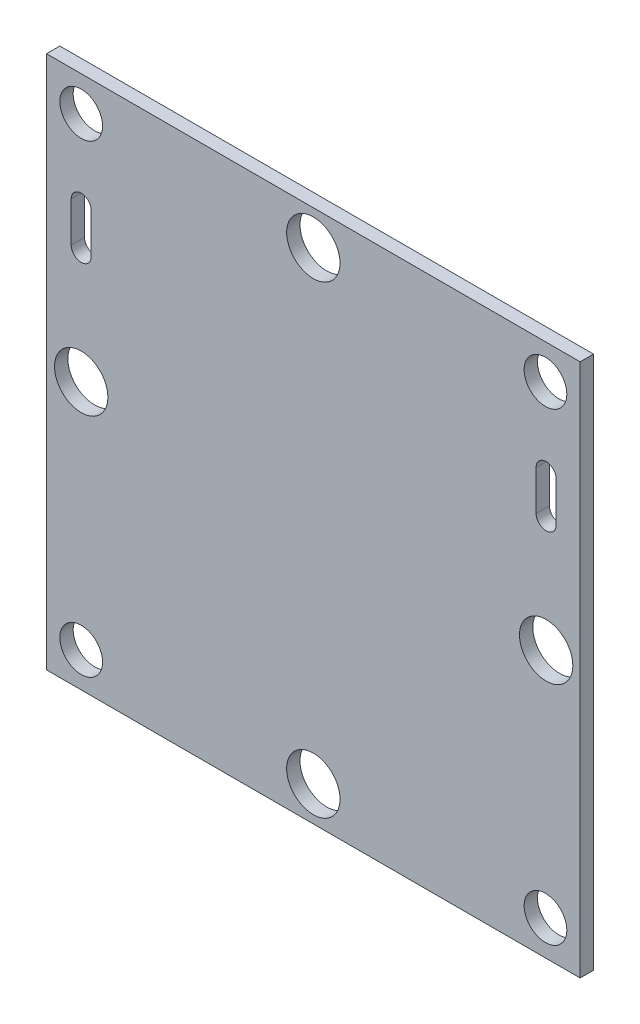
ISO-10303-21;
HEADER;
FILE_DESCRIPTION(('STEP AP214'),'2;1');
FILE_NAME('part.step','',(''),(''),'','','');
FILE_SCHEMA(('AUTOMOTIVE_DESIGN { 1 0 10303 214 1 1 1 1 }'));
ENDSEC;
DATA;
#1=APPLICATION_CONTEXT('core data for automotive mechanical design processes');
#2=APPLICATION_PROTOCOL_DEFINITION('international standard','automotive_design',2000,#1);
#3=PRODUCT_CONTEXT('',#1,'mechanical');
#4=PRODUCT('Part','Part','',(#3));
#5=PRODUCT_RELATED_PRODUCT_CATEGORY('part','',(#4));
#6=PRODUCT_DEFINITION_FORMATION('','',#4);
#7=PRODUCT_DEFINITION_CONTEXT('part definition',#1,'design');
#8=PRODUCT_DEFINITION('design','',#6,#7);
#9=PRODUCT_DEFINITION_SHAPE('','',#8);
#10=(LENGTH_UNIT() NAMED_UNIT(*) SI_UNIT(.MILLI.,.METRE.));
#11=(NAMED_UNIT(*) PLANE_ANGLE_UNIT() SI_UNIT($,.RADIAN.));
#12=(NAMED_UNIT(*) SI_UNIT($,.STERADIAN.) SOLID_ANGLE_UNIT());
#13=UNCERTAINTY_MEASURE_WITH_UNIT(LENGTH_MEASURE(1.E-05),#10,'distance_accuracy_value','');
#14=(GEOMETRIC_REPRESENTATION_CONTEXT(3) GLOBAL_UNCERTAINTY_ASSIGNED_CONTEXT((#13)) GLOBAL_UNIT_ASSIGNED_CONTEXT((#10,
#11,#12)) REPRESENTATION_CONTEXT('',''));
#15=CARTESIAN_POINT('',(0.,0.,0.));
#16=DIRECTION('',(0.,0.,1.));
#17=DIRECTION('',(1.,0.,0.));
#18=AXIS2_PLACEMENT_3D('',#15,#16,#17);
#19=CARTESIAN_POINT('',(20.,20.,1.));
#20=DIRECTION('',(-1.,0.,0.));
#21=DIRECTION('',(0.,0.,1.));
#22=AXIS2_PLACEMENT_3D('',#19,#20,#21);
#23=PLANE('',#22);
#24=DIRECTION('',(0.,1.,0.));
#25=VECTOR('',#24,1.);
#26=CARTESIAN_POINT('',(20.,20.,0.));
#27=LINE('',#26,#25);
#28=CARTESIAN_POINT('',(20.,-20.,0.));
#29=VERTEX_POINT('',#28);
#30=CARTESIAN_POINT('',(20.,20.,0.));
#31=VERTEX_POINT('',#30);
#32=EDGE_CURVE('E211',#29,#31,#27,.T.);
#33=ORIENTED_EDGE('',*,*,#32,.T.);
#34=DIRECTION('',(0.,0.,-1.));
#35=VECTOR('',#34,1.);
#36=CARTESIAN_POINT('',(20.,20.,1.));
#37=LINE('',#36,#35);
#38=CARTESIAN_POINT('',(20.,20.,1.));
#39=VERTEX_POINT('',#38);
#40=EDGE_CURVE('E227',#39,#31,#37,.T.);
#41=ORIENTED_EDGE('',*,*,#40,.F.);
#42=DIRECTION('',(0.,1.,0.));
#43=VECTOR('',#42,1.);
#44=CARTESIAN_POINT('',(20.,20.,1.));
#45=LINE('',#44,#43);
#46=CARTESIAN_POINT('',(20.,-20.,1.));
#47=VERTEX_POINT('',#46);
#48=EDGE_CURVE('E200',#47,#39,#45,.T.);
#49=ORIENTED_EDGE('',*,*,#48,.F.);
#50=DIRECTION('',(0.,0.,-1.));
#51=VECTOR('',#50,1.);
#52=CARTESIAN_POINT('',(20.,-20.,1.));
#53=LINE('',#52,#51);
#54=EDGE_CURVE('E210',#47,#29,#53,.T.);
#55=ORIENTED_EDGE('',*,*,#54,.T.);
#56=EDGE_LOOP('',(#33,#41,#49,#55));
#57=FACE_BOUND('',#56,.T.);
#58=ADVANCED_FACE('F32',(#57),#23,.F.);
#59=CARTESIAN_POINT('',(-20.,20.,1.));
#60=DIRECTION('',(0.,-1.,0.));
#61=DIRECTION('',(0.,0.,-1.));
#62=AXIS2_PLACEMENT_3D('',#59,#60,#61);
#63=PLANE('',#62);
#64=DIRECTION('',(-1.,0.,0.));
#65=VECTOR('',#64,1.);
#66=CARTESIAN_POINT('',(-20.,20.,0.));
#67=LINE('',#66,#65);
#68=CARTESIAN_POINT('',(-20.,20.,0.));
#69=VERTEX_POINT('',#68);
#70=EDGE_CURVE('E214',#31,#69,#67,.T.);
#71=ORIENTED_EDGE('',*,*,#70,.T.);
#72=DIRECTION('',(0.,0.,-1.));
#73=VECTOR('',#72,1.);
#74=CARTESIAN_POINT('',(-20.,20.,1.));
#75=LINE('',#74,#73);
#76=CARTESIAN_POINT('',(-20.,20.,1.));
#77=VERTEX_POINT('',#76);
#78=EDGE_CURVE('E224',#77,#69,#75,.T.);
#79=ORIENTED_EDGE('',*,*,#78,.F.);
#80=DIRECTION('',(-1.,0.,0.));
#81=VECTOR('',#80,1.);
#82=CARTESIAN_POINT('',(-20.,20.,1.));
#83=LINE('',#82,#81);
#84=EDGE_CURVE('E203',#39,#77,#83,.T.);
#85=ORIENTED_EDGE('',*,*,#84,.F.);
#86=ORIENTED_EDGE('',*,*,#40,.T.);
#87=EDGE_LOOP('',(#71,#79,#85,#86));
#88=FACE_BOUND('',#87,.T.);
#89=ADVANCED_FACE('F282',(#88),#63,.F.);
#90=CARTESIAN_POINT('',(-20.,20.,1.));
#91=DIRECTION('',(1.,0.,0.));
#92=DIRECTION('',(0.,1.,0.));
#93=AXIS2_PLACEMENT_3D('',#90,#91,#92);
#94=PLANE('',#93);
#95=DIRECTION('',(0.,-1.,0.));
#96=VECTOR('',#95,1.);
#97=CARTESIAN_POINT('',(-20.,20.,0.));
#98=LINE('',#97,#96);
#99=CARTESIAN_POINT('',(-20.,-20.,0.));
#100=VERTEX_POINT('',#99);
#101=EDGE_CURVE('E216',#69,#100,#98,.T.);
#102=ORIENTED_EDGE('',*,*,#101,.T.);
#103=DIRECTION('',(0.,0.,-1.));
#104=VECTOR('',#103,1.);
#105=CARTESIAN_POINT('',(-20.,-20.,1.));
#106=LINE('',#105,#104);
#107=CARTESIAN_POINT('',(-20.,-20.,1.));
#108=VERTEX_POINT('',#107);
#109=EDGE_CURVE('E221',#108,#100,#106,.T.);
#110=ORIENTED_EDGE('',*,*,#109,.F.);
#111=DIRECTION('',(0.,-1.,0.));
#112=VECTOR('',#111,1.);
#113=CARTESIAN_POINT('',(-20.,20.,1.));
#114=LINE('',#113,#112);
#115=EDGE_CURVE('E206',#77,#108,#114,.T.);
#116=ORIENTED_EDGE('',*,*,#115,.F.);
#117=ORIENTED_EDGE('',*,*,#78,.T.);
#118=EDGE_LOOP('',(#102,#110,#116,#117));
#119=FACE_BOUND('',#118,.T.);
#120=ADVANCED_FACE('F287',(#119),#94,.F.);
#121=CARTESIAN_POINT('',(-20.,-20.,1.));
#122=DIRECTION('',(0.,1.,0.));
#123=DIRECTION('',(0.,0.,1.));
#124=AXIS2_PLACEMENT_3D('',#121,#122,#123);
#125=PLANE('',#124);
#126=DIRECTION('',(1.,0.,0.));
#127=VECTOR('',#126,1.);
#128=CARTESIAN_POINT('',(-20.,-20.,0.));
#129=LINE('',#128,#127);
#130=EDGE_CURVE('E204',#100,#29,#129,.T.);
#131=ORIENTED_EDGE('',*,*,#130,.T.);
#132=ORIENTED_EDGE('',*,*,#54,.F.);
#133=DIRECTION('',(1.,0.,0.));
#134=VECTOR('',#133,1.);
#135=CARTESIAN_POINT('',(-20.,-20.,1.));
#136=LINE('',#135,#134);
#137=EDGE_CURVE('E208',#108,#47,#136,.T.);
#138=ORIENTED_EDGE('',*,*,#137,.F.);
#139=ORIENTED_EDGE('',*,*,#109,.T.);
#140=EDGE_LOOP('',(#131,#132,#138,#139));
#141=FACE_BOUND('',#140,.T.);
#142=ADVANCED_FACE('F302',(#141),#125,.F.);
#143=CARTESIAN_POINT('',(0.,0.,1.));
#144=DIRECTION('',(0.,0.,1.));
#145=DIRECTION('',(1.,0.,0.));
#146=AXIS2_PLACEMENT_3D('',#143,#144,#145);
#147=PLANE('',#146);
#148=CARTESIAN_POINT('',(17.4506505270837,11.5,1.));
#149=DIRECTION('',(0.,0.,1.));
#150=DIRECTION('',(1.,0.,0.));
#151=AXIS2_PLACEMENT_3D('',#148,#149,#150);
#152=CIRCLE('',#151,0.750000000000001);
#153=CARTESIAN_POINT('',(18.2006505270837,11.5,1.));
#154=VERTEX_POINT('',#153);
#155=CARTESIAN_POINT('',(16.7006505270837,11.5,1.));
#156=VERTEX_POINT('',#155);
#157=EDGE_CURVE('E46',#154,#156,#152,.T.);
#158=ORIENTED_EDGE('',*,*,#157,.F.);
#159=DIRECTION('',(0.,1.,0.));
#160=VECTOR('',#159,1.);
#161=CARTESIAN_POINT('',(18.2006505270837,11.5,1.));
#162=LINE('',#161,#160);
#163=CARTESIAN_POINT('',(18.2006505270837,8.5,1.));
#164=VERTEX_POINT('',#163);
#165=EDGE_CURVE('E139',#164,#154,#162,.T.);
#166=ORIENTED_EDGE('',*,*,#165,.F.);
#167=CARTESIAN_POINT('',(17.4506505270837,8.5,1.));
#168=DIRECTION('',(0.,0.,1.));
#169=DIRECTION('',(1.,0.,0.));
#170=AXIS2_PLACEMENT_3D('',#167,#168,#169);
#171=CIRCLE('',#170,0.750000000000001);
#172=CARTESIAN_POINT('',(16.7006505270837,8.5,1.));
#173=VERTEX_POINT('',#172);
#174=EDGE_CURVE('E123',#173,#164,#171,.T.);
#175=ORIENTED_EDGE('',*,*,#174,.F.);
#176=DIRECTION('',(0.,-1.,0.));
#177=VECTOR('',#176,1.);
#178=CARTESIAN_POINT('',(16.7006505270837,11.5,1.));
#179=LINE('',#178,#177);
#180=EDGE_CURVE('E132',#156,#173,#179,.T.);
#181=ORIENTED_EDGE('',*,*,#180,.F.);
#182=EDGE_LOOP('',(#158,#166,#175,#181));
#183=FACE_BOUND('',#182,.T.);
#184=CARTESIAN_POINT('',(-17.4,11.5,1.));
#185=DIRECTION('',(0.,0.,1.));
#186=DIRECTION('',(1.,0.,0.));
#187=AXIS2_PLACEMENT_3D('',#184,#185,#186);
#188=CIRCLE('',#187,0.749999999999995);
#189=CARTESIAN_POINT('',(-16.65,11.5,1.));
#190=VERTEX_POINT('',#189);
#191=CARTESIAN_POINT('',(-18.15,11.5,1.));
#192=VERTEX_POINT('',#191);
#193=EDGE_CURVE('E146',#190,#192,#188,.T.);
#194=ORIENTED_EDGE('',*,*,#193,.F.);
#195=DIRECTION('',(0.,1.,0.));
#196=VECTOR('',#195,1.);
#197=CARTESIAN_POINT('',(-16.65,11.5,1.));
#198=LINE('',#197,#196);
#199=CARTESIAN_POINT('',(-16.65,8.5,1.));
#200=VERTEX_POINT('',#199);
#201=EDGE_CURVE('E156',#200,#190,#198,.T.);
#202=ORIENTED_EDGE('',*,*,#201,.F.);
#203=CARTESIAN_POINT('',(-17.4,8.5,1.));
#204=DIRECTION('',(0.,0.,1.));
#205=DIRECTION('',(1.,0.,0.));
#206=AXIS2_PLACEMENT_3D('',#203,#204,#205);
#207=CIRCLE('',#206,0.749999999999997);
#208=CARTESIAN_POINT('',(-18.15,8.5,1.));
#209=VERTEX_POINT('',#208);
#210=EDGE_CURVE('E153',#209,#200,#207,.T.);
#211=ORIENTED_EDGE('',*,*,#210,.F.);
#212=DIRECTION('',(0.,-1.,0.));
#213=VECTOR('',#212,1.);
#214=CARTESIAN_POINT('',(-18.15,11.5,1.));
#215=LINE('',#214,#213);
#216=EDGE_CURVE('E150',#192,#209,#215,.T.);
#217=ORIENTED_EDGE('',*,*,#216,.F.);
#218=EDGE_LOOP('',(#194,#202,#211,#217));
#219=FACE_BOUND('',#218,.T.);
#220=CARTESIAN_POINT('',(-17.4,0.,1.));
#221=DIRECTION('',(0.,0.,1.));
#222=DIRECTION('',(1.,0.,0.));
#223=AXIS2_PLACEMENT_3D('',#220,#221,#222);
#224=CIRCLE('',#223,2.);
#225=CARTESIAN_POINT('',(-15.4,0.,1.));
#226=VERTEX_POINT('',#225);
#227=EDGE_CURVE('E162',#226,#226,#224,.T.);
#228=ORIENTED_EDGE('',*,*,#227,.F.);
#229=EDGE_LOOP('',(#228));
#230=FACE_BOUND('',#229,.T.);
#231=CARTESIAN_POINT('',(0.,-17.4,1.));
#232=DIRECTION('',(0.,0.,1.));
#233=DIRECTION('',(1.,0.,0.));
#234=AXIS2_PLACEMENT_3D('',#231,#232,#233);
#235=CIRCLE('',#234,2.);
#236=CARTESIAN_POINT('',(2.,-17.4,1.));
#237=VERTEX_POINT('',#236);
#238=EDGE_CURVE('E172',#237,#237,#235,.T.);
#239=ORIENTED_EDGE('',*,*,#238,.F.);
#240=EDGE_LOOP('',(#239));
#241=FACE_BOUND('',#240,.T.);
#242=CARTESIAN_POINT('',(17.4506505270837,0.,1.));
#243=DIRECTION('',(0.,0.,1.));
#244=DIRECTION('',(1.,0.,0.));
#245=AXIS2_PLACEMENT_3D('',#242,#243,#244);
#246=CIRCLE('',#245,2.);
#247=CARTESIAN_POINT('',(19.4506505270837,0.,1.));
#248=VERTEX_POINT('',#247);
#249=EDGE_CURVE('E176',#248,#248,#246,.T.);
#250=ORIENTED_EDGE('',*,*,#249,.F.);
#251=EDGE_LOOP('',(#250));
#252=FACE_BOUND('',#251,.T.);
#253=CARTESIAN_POINT('',(0.,17.4,1.));
#254=DIRECTION('',(0.,0.,1.));
#255=DIRECTION('',(1.,0.,0.));
#256=AXIS2_PLACEMENT_3D('',#253,#254,#255);
#257=CIRCLE('',#256,2.);
#258=CARTESIAN_POINT('',(2.,17.4,1.));
#259=VERTEX_POINT('',#258);
#260=EDGE_CURVE('E180',#259,#259,#257,.T.);
#261=ORIENTED_EDGE('',*,*,#260,.F.);
#262=EDGE_LOOP('',(#261));
#263=FACE_BOUND('',#262,.T.);
#264=CARTESIAN_POINT('',(-17.4,17.4,1.));
#265=DIRECTION('',(0.,0.,1.));
#266=DIRECTION('',(1.,0.,0.));
#267=AXIS2_PLACEMENT_3D('',#264,#265,#266);
#268=CIRCLE('',#267,1.6);
#269=CARTESIAN_POINT('',(-15.8,17.4,1.));
#270=VERTEX_POINT('',#269);
#271=EDGE_CURVE('E184',#270,#270,#268,.T.);
#272=ORIENTED_EDGE('',*,*,#271,.F.);
#273=EDGE_LOOP('',(#272));
#274=FACE_BOUND('',#273,.T.);
#275=CARTESIAN_POINT('',(17.4,17.4,1.));
#276=DIRECTION('',(0.,0.,1.));
#277=DIRECTION('',(1.,0.,0.));
#278=AXIS2_PLACEMENT_3D('',#275,#276,#277);
#279=CIRCLE('',#278,1.6);
#280=CARTESIAN_POINT('',(19.,17.4,1.));
#281=VERTEX_POINT('',#280);
#282=EDGE_CURVE('E188',#281,#281,#279,.T.);
#283=ORIENTED_EDGE('',*,*,#282,.F.);
#284=EDGE_LOOP('',(#283));
#285=FACE_BOUND('',#284,.T.);
#286=CARTESIAN_POINT('',(17.4,-17.4,1.));
#287=DIRECTION('',(0.,0.,1.));
#288=DIRECTION('',(1.,0.,0.));
#289=AXIS2_PLACEMENT_3D('',#286,#287,#288);
#290=CIRCLE('',#289,1.6);
#291=CARTESIAN_POINT('',(19.,-17.4,1.));
#292=VERTEX_POINT('',#291);
#293=EDGE_CURVE('E192',#292,#292,#290,.T.);
#294=ORIENTED_EDGE('',*,*,#293,.F.);
#295=EDGE_LOOP('',(#294));
#296=FACE_BOUND('',#295,.T.);
#297=CARTESIAN_POINT('',(-17.4,-17.4,1.));
#298=DIRECTION('',(0.,0.,1.));
#299=DIRECTION('',(1.,0.,0.));
#300=AXIS2_PLACEMENT_3D('',#297,#298,#299);
#301=CIRCLE('',#300,1.6);
#302=CARTESIAN_POINT('',(-15.8,-17.4,1.));
#303=VERTEX_POINT('',#302);
#304=EDGE_CURVE('E196',#303,#303,#301,.T.);
#305=ORIENTED_EDGE('',*,*,#304,.F.);
#306=EDGE_LOOP('',(#305));
#307=FACE_BOUND('',#306,.T.);
#308=ORIENTED_EDGE('',*,*,#48,.T.);
#309=ORIENTED_EDGE('',*,*,#84,.T.);
#310=ORIENTED_EDGE('',*,*,#115,.T.);
#311=ORIENTED_EDGE('',*,*,#137,.T.);
#312=EDGE_LOOP('',(#308,#309,#310,#311));
#313=FACE_BOUND('',#312,.T.);
#314=ADVANCED_FACE('F136',(#183,#219,#230,#241,#252,#263,#274,#285,#296,#307,#313),#147,.T.);
#315=CARTESIAN_POINT('',(0.,0.,0.));
#316=DIRECTION('',(0.,0.,1.));
#317=DIRECTION('',(1.,0.,0.));
#318=AXIS2_PLACEMENT_3D('',#315,#316,#317);
#319=PLANE('',#318);
#320=DIRECTION('',(0.,1.,0.));
#321=VECTOR('',#320,1.);
#322=CARTESIAN_POINT('',(18.2006505270837,0.,0.));
#323=LINE('',#322,#321);
#324=CARTESIAN_POINT('',(18.2006505270837,8.5,0.));
#325=VERTEX_POINT('',#324);
#326=CARTESIAN_POINT('',(18.2006505270837,11.5,0.));
#327=VERTEX_POINT('',#326);
#328=EDGE_CURVE('E39',#325,#327,#323,.T.);
#329=ORIENTED_EDGE('',*,*,#328,.T.);
#330=CARTESIAN_POINT('',(17.4506505270837,11.5,0.));
#331=DIRECTION('',(0.,0.,1.));
#332=DIRECTION('',(1.,0.,0.));
#333=AXIS2_PLACEMENT_3D('',#330,#331,#332);
#334=CIRCLE('',#333,0.750000000000001);
#335=CARTESIAN_POINT('',(16.7006505270837,11.5,0.));
#336=VERTEX_POINT('',#335);
#337=EDGE_CURVE('E11',#327,#336,#334,.T.);
#338=ORIENTED_EDGE('',*,*,#337,.T.);
#339=DIRECTION('',(0.,-1.,0.));
#340=VECTOR('',#339,1.);
#341=CARTESIAN_POINT('',(16.7006505270837,0.,0.));
#342=LINE('',#341,#340);
#343=CARTESIAN_POINT('',(16.7006505270837,8.5,0.));
#344=VERTEX_POINT('',#343);
#345=EDGE_CURVE('E258',#336,#344,#342,.T.);
#346=ORIENTED_EDGE('',*,*,#345,.T.);
#347=CARTESIAN_POINT('',(17.4506505270837,8.5,0.));
#348=DIRECTION('',(0.,0.,1.));
#349=DIRECTION('',(1.,0.,0.));
#350=AXIS2_PLACEMENT_3D('',#347,#348,#349);
#351=CIRCLE('',#350,0.750000000000001);
#352=EDGE_CURVE('E126',#344,#325,#351,.T.);
#353=ORIENTED_EDGE('',*,*,#352,.T.);
#354=EDGE_LOOP('',(#329,#338,#346,#353));
#355=FACE_BOUND('',#354,.T.);
#356=DIRECTION('',(0.,1.,0.));
#357=VECTOR('',#356,1.);
#358=CARTESIAN_POINT('',(-16.65,0.,0.));
#359=LINE('',#358,#357);
#360=CARTESIAN_POINT('',(-16.65,8.5,0.));
#361=VERTEX_POINT('',#360);
#362=CARTESIAN_POINT('',(-16.65,11.5,0.));
#363=VERTEX_POINT('',#362);
#364=EDGE_CURVE('E252',#361,#363,#359,.T.);
#365=ORIENTED_EDGE('',*,*,#364,.T.);
#366=CARTESIAN_POINT('',(-17.4,11.5,0.));
#367=DIRECTION('',(0.,0.,1.));
#368=DIRECTION('',(1.,0.,0.));
#369=AXIS2_PLACEMENT_3D('',#366,#367,#368);
#370=CIRCLE('',#369,0.749999999999995);
#371=CARTESIAN_POINT('',(-18.15,11.5,0.));
#372=VERTEX_POINT('',#371);
#373=EDGE_CURVE('E255',#363,#372,#370,.T.);
#374=ORIENTED_EDGE('',*,*,#373,.T.);
#375=DIRECTION('',(0.,-1.,0.));
#376=VECTOR('',#375,1.);
#377=CARTESIAN_POINT('',(-18.15,0.,0.));
#378=LINE('',#377,#376);
#379=CARTESIAN_POINT('',(-18.15,8.5,0.));
#380=VERTEX_POINT('',#379);
#381=EDGE_CURVE('E230',#372,#380,#378,.T.);
#382=ORIENTED_EDGE('',*,*,#381,.T.);
#383=CARTESIAN_POINT('',(-17.4,8.5,0.));
#384=DIRECTION('',(0.,0.,1.));
#385=DIRECTION('',(1.,0.,0.));
#386=AXIS2_PLACEMENT_3D('',#383,#384,#385);
#387=CIRCLE('',#386,0.749999999999997);
#388=EDGE_CURVE('E249',#380,#361,#387,.T.);
#389=ORIENTED_EDGE('',*,*,#388,.T.);
#390=EDGE_LOOP('',(#365,#374,#382,#389));
#391=FACE_BOUND('',#390,.T.);
#392=CARTESIAN_POINT('',(-17.4,0.,0.));
#393=DIRECTION('',(0.,0.,1.));
#394=DIRECTION('',(1.,0.,0.));
#395=AXIS2_PLACEMENT_3D('',#392,#393,#394);
#396=CIRCLE('',#395,2.);
#397=CARTESIAN_POINT('',(-15.4,0.,0.));
#398=VERTEX_POINT('',#397);
#399=EDGE_CURVE('E171',#398,#398,#396,.T.);
#400=ORIENTED_EDGE('',*,*,#399,.T.);
#401=EDGE_LOOP('',(#400));
#402=FACE_BOUND('',#401,.T.);
#403=CARTESIAN_POINT('',(0.,-17.4,0.));
#404=DIRECTION('',(0.,0.,1.));
#405=DIRECTION('',(1.,0.,0.));
#406=AXIS2_PLACEMENT_3D('',#403,#404,#405);
#407=CIRCLE('',#406,2.);
#408=CARTESIAN_POINT('',(2.,-17.4,0.));
#409=VERTEX_POINT('',#408);
#410=EDGE_CURVE('E175',#409,#409,#407,.T.);
#411=ORIENTED_EDGE('',*,*,#410,.T.);
#412=EDGE_LOOP('',(#411));
#413=FACE_BOUND('',#412,.T.);
#414=CARTESIAN_POINT('',(17.4506505270837,0.,0.));
#415=DIRECTION('',(0.,0.,1.));
#416=DIRECTION('',(1.,0.,0.));
#417=AXIS2_PLACEMENT_3D('',#414,#415,#416);
#418=CIRCLE('',#417,2.);
#419=CARTESIAN_POINT('',(19.4506505270837,0.,0.));
#420=VERTEX_POINT('',#419);
#421=EDGE_CURVE('E179',#420,#420,#418,.T.);
#422=ORIENTED_EDGE('',*,*,#421,.T.);
#423=EDGE_LOOP('',(#422));
#424=FACE_BOUND('',#423,.T.);
#425=CARTESIAN_POINT('',(0.,17.4,0.));
#426=DIRECTION('',(0.,0.,1.));
#427=DIRECTION('',(1.,0.,0.));
#428=AXIS2_PLACEMENT_3D('',#425,#426,#427);
#429=CIRCLE('',#428,2.);
#430=CARTESIAN_POINT('',(2.,17.4,0.));
#431=VERTEX_POINT('',#430);
#432=EDGE_CURVE('E183',#431,#431,#429,.T.);
#433=ORIENTED_EDGE('',*,*,#432,.T.);
#434=EDGE_LOOP('',(#433));
#435=FACE_BOUND('',#434,.T.);
#436=CARTESIAN_POINT('',(-17.4,17.4,0.));
#437=DIRECTION('',(0.,0.,1.));
#438=DIRECTION('',(1.,0.,0.));
#439=AXIS2_PLACEMENT_3D('',#436,#437,#438);
#440=CIRCLE('',#439,1.6);
#441=CARTESIAN_POINT('',(-15.8,17.4,0.));
#442=VERTEX_POINT('',#441);
#443=EDGE_CURVE('E187',#442,#442,#440,.T.);
#444=ORIENTED_EDGE('',*,*,#443,.T.);
#445=EDGE_LOOP('',(#444));
#446=FACE_BOUND('',#445,.T.);
#447=CARTESIAN_POINT('',(17.4,17.4,0.));
#448=DIRECTION('',(0.,0.,1.));
#449=DIRECTION('',(1.,0.,0.));
#450=AXIS2_PLACEMENT_3D('',#447,#448,#449);
#451=CIRCLE('',#450,1.6);
#452=CARTESIAN_POINT('',(19.,17.4,0.));
#453=VERTEX_POINT('',#452);
#454=EDGE_CURVE('E191',#453,#453,#451,.T.);
#455=ORIENTED_EDGE('',*,*,#454,.T.);
#456=EDGE_LOOP('',(#455));
#457=FACE_BOUND('',#456,.T.);
#458=CARTESIAN_POINT('',(17.4,-17.4,0.));
#459=DIRECTION('',(0.,0.,1.));
#460=DIRECTION('',(1.,0.,0.));
#461=AXIS2_PLACEMENT_3D('',#458,#459,#460);
#462=CIRCLE('',#461,1.6);
#463=CARTESIAN_POINT('',(19.,-17.4,0.));
#464=VERTEX_POINT('',#463);
#465=EDGE_CURVE('E195',#464,#464,#462,.T.);
#466=ORIENTED_EDGE('',*,*,#465,.T.);
#467=EDGE_LOOP('',(#466));
#468=FACE_BOUND('',#467,.T.);
#469=CARTESIAN_POINT('',(-17.4,-17.4,0.));
#470=DIRECTION('',(0.,0.,1.));
#471=DIRECTION('',(1.,0.,0.));
#472=AXIS2_PLACEMENT_3D('',#469,#470,#471);
#473=CIRCLE('',#472,1.6);
#474=CARTESIAN_POINT('',(-15.8,-17.4,0.));
#475=VERTEX_POINT('',#474);
#476=EDGE_CURVE('E199',#475,#475,#473,.T.);
#477=ORIENTED_EDGE('',*,*,#476,.T.);
#478=EDGE_LOOP('',(#477));
#479=FACE_BOUND('',#478,.T.);
#480=ORIENTED_EDGE('',*,*,#32,.F.);
#481=ORIENTED_EDGE('',*,*,#130,.F.);
#482=ORIENTED_EDGE('',*,*,#101,.F.);
#483=ORIENTED_EDGE('',*,*,#70,.F.);
#484=EDGE_LOOP('',(#480,#481,#482,#483));
#485=FACE_BOUND('',#484,.T.);
#486=ADVANCED_FACE('F262',(#355,#391,#402,#413,#424,#435,#446,#457,#468,#479,#485),#319,.F.);
#487=CARTESIAN_POINT('',(-17.4,-17.4,-9.));
#488=DIRECTION('',(0.,0.,1.));
#489=DIRECTION('',(1.,0.,0.));
#490=AXIS2_PLACEMENT_3D('',#487,#488,#489);
#491=CYLINDRICAL_SURFACE('',#490,1.6);
#492=ORIENTED_EDGE('',*,*,#304,.T.);
#493=EDGE_LOOP('',(#492));
#494=FACE_BOUND('',#493,.T.);
#495=ORIENTED_EDGE('',*,*,#476,.F.);
#496=EDGE_LOOP('',(#495));
#497=FACE_BOUND('',#496,.T.);
#498=ADVANCED_FACE('F313',(#494,#497),#491,.F.);
#499=CARTESIAN_POINT('',(17.4,-17.4,-9.));
#500=DIRECTION('',(0.,0.,1.));
#501=DIRECTION('',(1.,0.,0.));
#502=AXIS2_PLACEMENT_3D('',#499,#500,#501);
#503=CYLINDRICAL_SURFACE('',#502,1.6);
#504=ORIENTED_EDGE('',*,*,#293,.T.);
#505=EDGE_LOOP('',(#504));
#506=FACE_BOUND('',#505,.T.);
#507=ORIENTED_EDGE('',*,*,#465,.F.);
#508=EDGE_LOOP('',(#507));
#509=FACE_BOUND('',#508,.T.);
#510=ADVANCED_FACE('F318',(#506,#509),#503,.F.);
#511=CARTESIAN_POINT('',(17.4,17.4,-9.));
#512=DIRECTION('',(0.,0.,1.));
#513=DIRECTION('',(1.,0.,0.));
#514=AXIS2_PLACEMENT_3D('',#511,#512,#513);
#515=CYLINDRICAL_SURFACE('',#514,1.6);
#516=ORIENTED_EDGE('',*,*,#282,.T.);
#517=EDGE_LOOP('',(#516));
#518=FACE_BOUND('',#517,.T.);
#519=ORIENTED_EDGE('',*,*,#454,.F.);
#520=EDGE_LOOP('',(#519));
#521=FACE_BOUND('',#520,.T.);
#522=ADVANCED_FACE('F322',(#518,#521),#515,.F.);
#523=CARTESIAN_POINT('',(-17.4,17.4,-9.));
#524=DIRECTION('',(0.,0.,1.));
#525=DIRECTION('',(1.,0.,0.));
#526=AXIS2_PLACEMENT_3D('',#523,#524,#525);
#527=CYLINDRICAL_SURFACE('',#526,1.6);
#528=ORIENTED_EDGE('',*,*,#271,.T.);
#529=EDGE_LOOP('',(#528));
#530=FACE_BOUND('',#529,.T.);
#531=ORIENTED_EDGE('',*,*,#443,.F.);
#532=EDGE_LOOP('',(#531));
#533=FACE_BOUND('',#532,.T.);
#534=ADVANCED_FACE('F326',(#530,#533),#527,.F.);
#535=CARTESIAN_POINT('',(0.,17.4,-9.));
#536=DIRECTION('',(0.,0.,1.));
#537=DIRECTION('',(1.,0.,0.));
#538=AXIS2_PLACEMENT_3D('',#535,#536,#537);
#539=CYLINDRICAL_SURFACE('',#538,2.);
#540=ORIENTED_EDGE('',*,*,#260,.T.);
#541=EDGE_LOOP('',(#540));
#542=FACE_BOUND('',#541,.T.);
#543=ORIENTED_EDGE('',*,*,#432,.F.);
#544=EDGE_LOOP('',(#543));
#545=FACE_BOUND('',#544,.T.);
#546=ADVANCED_FACE('F330',(#542,#545),#539,.F.);
#547=CARTESIAN_POINT('',(17.4506505270837,0.,-9.));
#548=DIRECTION('',(0.,0.,1.));
#549=DIRECTION('',(1.,0.,0.));
#550=AXIS2_PLACEMENT_3D('',#547,#548,#549);
#551=CYLINDRICAL_SURFACE('',#550,2.);
#552=ORIENTED_EDGE('',*,*,#249,.T.);
#553=EDGE_LOOP('',(#552));
#554=FACE_BOUND('',#553,.T.);
#555=ORIENTED_EDGE('',*,*,#421,.F.);
#556=EDGE_LOOP('',(#555));
#557=FACE_BOUND('',#556,.T.);
#558=ADVANCED_FACE('F334',(#554,#557),#551,.F.);
#559=CARTESIAN_POINT('',(0.,-17.4,-9.));
#560=DIRECTION('',(0.,0.,1.));
#561=DIRECTION('',(1.,0.,0.));
#562=AXIS2_PLACEMENT_3D('',#559,#560,#561);
#563=CYLINDRICAL_SURFACE('',#562,2.);
#564=ORIENTED_EDGE('',*,*,#238,.T.);
#565=EDGE_LOOP('',(#564));
#566=FACE_BOUND('',#565,.T.);
#567=ORIENTED_EDGE('',*,*,#410,.F.);
#568=EDGE_LOOP('',(#567));
#569=FACE_BOUND('',#568,.T.);
#570=ADVANCED_FACE('F338',(#566,#569),#563,.F.);
#571=CARTESIAN_POINT('',(-17.4,0.,-9.));
#572=DIRECTION('',(0.,0.,1.));
#573=DIRECTION('',(1.,0.,0.));
#574=AXIS2_PLACEMENT_3D('',#571,#572,#573);
#575=CYLINDRICAL_SURFACE('',#574,2.);
#576=ORIENTED_EDGE('',*,*,#227,.T.);
#577=EDGE_LOOP('',(#576));
#578=FACE_BOUND('',#577,.T.);
#579=ORIENTED_EDGE('',*,*,#399,.F.);
#580=EDGE_LOOP('',(#579));
#581=FACE_BOUND('',#580,.T.);
#582=ADVANCED_FACE('F342',(#578,#581),#575,.F.);
#583=CARTESIAN_POINT('',(-17.4,11.5,-9.));
#584=DIRECTION('',(0.,0.,1.));
#585=DIRECTION('',(1.,0.,0.));
#586=AXIS2_PLACEMENT_3D('',#583,#584,#585);
#587=CYLINDRICAL_SURFACE('',#586,0.749999999999995);
#588=DIRECTION('',(0.,0.,1.));
#589=VECTOR('',#588,1.);
#590=CARTESIAN_POINT('',(-16.65,11.5,-9.));
#591=LINE('',#590,#589);
#592=EDGE_CURVE('E160',#363,#190,#591,.T.);
#593=ORIENTED_EDGE('',*,*,#592,.T.);
#594=ORIENTED_EDGE('',*,*,#193,.T.);
#595=DIRECTION('',(0.,0.,1.));
#596=VECTOR('',#595,1.);
#597=CARTESIAN_POINT('',(-18.15,11.5,-9.));
#598=LINE('',#597,#596);
#599=EDGE_CURVE('E159',#372,#192,#598,.T.);
#600=ORIENTED_EDGE('',*,*,#599,.F.);
#601=ORIENTED_EDGE('',*,*,#373,.F.);
#602=EDGE_LOOP('',(#593,#594,#600,#601));
#603=FACE_BOUND('',#602,.T.);
#604=ADVANCED_FACE('F346',(#603),#587,.F.);
#605=CARTESIAN_POINT('',(-16.65,11.5,-9.));
#606=DIRECTION('',(1.,0.,0.));
#607=DIRECTION('',(0.,1.,0.));
#608=AXIS2_PLACEMENT_3D('',#605,#606,#607);
#609=PLANE('',#608);
#610=DIRECTION('',(0.,0.,1.));
#611=VECTOR('',#610,1.);
#612=CARTESIAN_POINT('',(-16.65,8.5,-9.));
#613=LINE('',#612,#611);
#614=EDGE_CURVE('E163',#361,#200,#613,.T.);
#615=ORIENTED_EDGE('',*,*,#614,.T.);
#616=ORIENTED_EDGE('',*,*,#201,.T.);
#617=ORIENTED_EDGE('',*,*,#592,.F.);
#618=ORIENTED_EDGE('',*,*,#364,.F.);
#619=EDGE_LOOP('',(#615,#616,#617,#618));
#620=FACE_BOUND('',#619,.T.);
#621=ADVANCED_FACE('F349',(#620),#609,.F.);
#622=CARTESIAN_POINT('',(-17.4,8.5,-9.));
#623=DIRECTION('',(0.,0.,1.));
#624=DIRECTION('',(1.,0.,0.));
#625=AXIS2_PLACEMENT_3D('',#622,#623,#624);
#626=CYLINDRICAL_SURFACE('',#625,0.749999999999997);
#627=DIRECTION('',(0.,0.,1.));
#628=VECTOR('',#627,1.);
#629=CARTESIAN_POINT('',(-18.15,8.5,-9.));
#630=LINE('',#629,#628);
#631=EDGE_CURVE('E165',#380,#209,#630,.T.);
#632=ORIENTED_EDGE('',*,*,#631,.T.);
#633=ORIENTED_EDGE('',*,*,#210,.T.);
#634=ORIENTED_EDGE('',*,*,#614,.F.);
#635=ORIENTED_EDGE('',*,*,#388,.F.);
#636=EDGE_LOOP('',(#632,#633,#634,#635));
#637=FACE_BOUND('',#636,.T.);
#638=ADVANCED_FACE('F276',(#637),#626,.F.);
#639=CARTESIAN_POINT('',(-18.15,11.5,-9.));
#640=DIRECTION('',(-1.,0.,0.));
#641=DIRECTION('',(0.,0.,1.));
#642=AXIS2_PLACEMENT_3D('',#639,#640,#641);
#643=PLANE('',#642);
#644=ORIENTED_EDGE('',*,*,#599,.T.);
#645=ORIENTED_EDGE('',*,*,#216,.T.);
#646=ORIENTED_EDGE('',*,*,#631,.F.);
#647=ORIENTED_EDGE('',*,*,#381,.F.);
#648=EDGE_LOOP('',(#644,#645,#646,#647));
#649=FACE_BOUND('',#648,.T.);
#650=ADVANCED_FACE('F269',(#649),#643,.F.);
#651=CARTESIAN_POINT('',(17.4506505270837,11.5,-9.));
#652=DIRECTION('',(0.,0.,1.));
#653=DIRECTION('',(1.,0.,0.));
#654=AXIS2_PLACEMENT_3D('',#651,#652,#653);
#655=CYLINDRICAL_SURFACE('',#654,0.750000000000001);
#656=DIRECTION('',(0.,0.,1.));
#657=VECTOR('',#656,1.);
#658=CARTESIAN_POINT('',(18.2006505270837,11.5,-9.));
#659=LINE('',#658,#657);
#660=EDGE_CURVE('E144',#327,#154,#659,.T.);
#661=ORIENTED_EDGE('',*,*,#660,.T.);
#662=ORIENTED_EDGE('',*,*,#157,.T.);
#663=DIRECTION('',(0.,0.,1.));
#664=VECTOR('',#663,1.);
#665=CARTESIAN_POINT('',(16.7006505270837,11.5,-9.));
#666=LINE('',#665,#664);
#667=EDGE_CURVE('E129',#336,#156,#666,.T.);
#668=ORIENTED_EDGE('',*,*,#667,.F.);
#669=ORIENTED_EDGE('',*,*,#337,.F.);
#670=EDGE_LOOP('',(#661,#662,#668,#669));
#671=FACE_BOUND('',#670,.T.);
#672=ADVANCED_FACE('F267',(#671),#655,.F.);
#673=CARTESIAN_POINT('',(18.2006505270837,11.5,-9.));
#674=DIRECTION('',(1.,0.,0.));
#675=DIRECTION('',(0.,0.,-1.));
#676=AXIS2_PLACEMENT_3D('',#673,#674,#675);
#677=PLANE('',#676);
#678=DIRECTION('',(0.,0.,1.));
#679=VECTOR('',#678,1.);
#680=CARTESIAN_POINT('',(18.2006505270837,8.5,-9.));
#681=LINE('',#680,#679);
#682=EDGE_CURVE('E128',#325,#164,#681,.T.);
#683=ORIENTED_EDGE('',*,*,#682,.T.);
#684=ORIENTED_EDGE('',*,*,#165,.T.);
#685=ORIENTED_EDGE('',*,*,#660,.F.);
#686=ORIENTED_EDGE('',*,*,#328,.F.);
#687=EDGE_LOOP('',(#683,#684,#685,#686));
#688=FACE_BOUND('',#687,.T.);
#689=ADVANCED_FACE('F266',(#688),#677,.F.);
#690=CARTESIAN_POINT('',(17.4506505270837,8.5,-9.));
#691=DIRECTION('',(0.,0.,1.));
#692=DIRECTION('',(1.,0.,0.));
#693=AXIS2_PLACEMENT_3D('',#690,#691,#692);
#694=CYLINDRICAL_SURFACE('',#693,0.750000000000001);
#695=DIRECTION('',(0.,0.,1.));
#696=VECTOR('',#695,1.);
#697=CARTESIAN_POINT('',(16.7006505270837,8.5,-9.));
#698=LINE('',#697,#696);
#699=EDGE_CURVE('E54',#344,#173,#698,.T.);
#700=ORIENTED_EDGE('',*,*,#699,.T.);
#701=ORIENTED_EDGE('',*,*,#174,.T.);
#702=ORIENTED_EDGE('',*,*,#682,.F.);
#703=ORIENTED_EDGE('',*,*,#352,.F.);
#704=EDGE_LOOP('',(#700,#701,#702,#703));
#705=FACE_BOUND('',#704,.T.);
#706=ADVANCED_FACE('F120',(#705),#694,.F.);
#707=CARTESIAN_POINT('',(16.7006505270837,11.5,-9.));
#708=DIRECTION('',(-1.,0.,0.));
#709=DIRECTION('',(0.,0.,1.));
#710=AXIS2_PLACEMENT_3D('',#707,#708,#709);
#711=PLANE('',#710);
#712=ORIENTED_EDGE('',*,*,#667,.T.);
#713=ORIENTED_EDGE('',*,*,#180,.T.);
#714=ORIENTED_EDGE('',*,*,#699,.F.);
#715=ORIENTED_EDGE('',*,*,#345,.F.);
#716=EDGE_LOOP('',(#712,#713,#714,#715));
#717=FACE_BOUND('',#716,.T.);
#718=ADVANCED_FACE('F133',(#717),#711,.F.);
#719=CLOSED_SHELL('',(#58,#89,#120,#142,#314,#486,#498,#510,#522,#534,#546,#558,#570,#582,#604,
#621,#638,#650,#672,#689,#706,#718));
#720=MANIFOLD_SOLID_BREP('B2',#719);
#721=ADVANCED_BREP_SHAPE_REPRESENTATION('',(#18,#720),#14);
#722=SHAPE_DEFINITION_REPRESENTATION(#9,#721);
ENDSEC;
END-ISO-10303-21;
